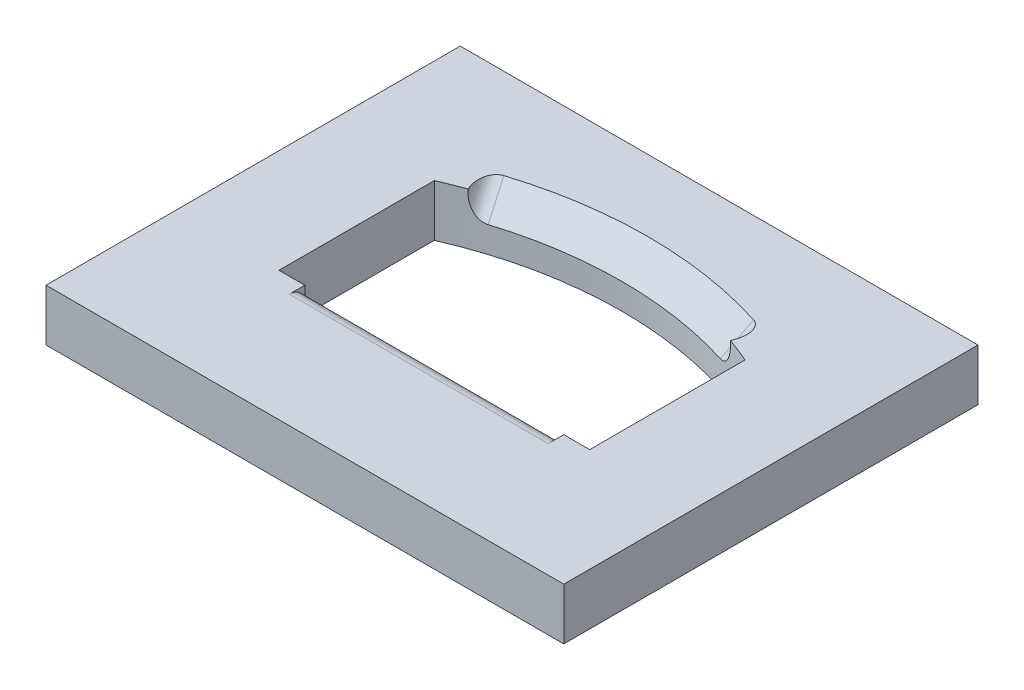
ISO-10303-21;
HEADER;
FILE_DESCRIPTION(('STEP AP214'),'2;1');
FILE_NAME('part.step','',(''),(''),'','','');
FILE_SCHEMA(('AUTOMOTIVE_DESIGN { 1 0 10303 214 1 1 1 1 }'));
ENDSEC;
DATA;
#1=APPLICATION_CONTEXT('core data for automotive mechanical design processes');
#2=APPLICATION_PROTOCOL_DEFINITION('international standard','automotive_design',2000,#1);
#3=PRODUCT_CONTEXT('',#1,'mechanical');
#4=PRODUCT('Part','Part','',(#3));
#5=PRODUCT_RELATED_PRODUCT_CATEGORY('part','',(#4));
#6=PRODUCT_DEFINITION_FORMATION('','',#4);
#7=PRODUCT_DEFINITION_CONTEXT('part definition',#1,'design');
#8=PRODUCT_DEFINITION('design','',#6,#7);
#9=PRODUCT_DEFINITION_SHAPE('','',#8);
#10=(LENGTH_UNIT() NAMED_UNIT(*) SI_UNIT(.MILLI.,.METRE.));
#11=(NAMED_UNIT(*) PLANE_ANGLE_UNIT() SI_UNIT($,.RADIAN.));
#12=(NAMED_UNIT(*) SI_UNIT($,.STERADIAN.) SOLID_ANGLE_UNIT());
#13=UNCERTAINTY_MEASURE_WITH_UNIT(LENGTH_MEASURE(1.E-05),#10,'distance_accuracy_value','');
#14=(GEOMETRIC_REPRESENTATION_CONTEXT(3) GLOBAL_UNCERTAINTY_ASSIGNED_CONTEXT((#13)) GLOBAL_UNIT_ASSIGNED_CONTEXT((#10,
#11,#12)) REPRESENTATION_CONTEXT('',''));
#15=CARTESIAN_POINT('',(0.,0.,0.));
#16=DIRECTION('',(0.,0.,1.));
#17=DIRECTION('',(1.,0.,0.));
#18=AXIS2_PLACEMENT_3D('',#15,#16,#17);
#19=CARTESIAN_POINT('',(50.,10.,40.));
#20=DIRECTION('',(-1.,0.,0.));
#21=DIRECTION('',(0.,0.,1.));
#22=AXIS2_PLACEMENT_3D('',#19,#20,#21);
#23=PLANE('',#22);
#24=DIRECTION('',(0.,0.,-1.));
#25=VECTOR('',#24,1.);
#26=CARTESIAN_POINT('',(50.,0.,40.));
#27=LINE('',#26,#25);
#28=CARTESIAN_POINT('',(50.,0.,40.));
#29=VERTEX_POINT('',#28);
#30=CARTESIAN_POINT('',(50.,0.,-40.));
#31=VERTEX_POINT('',#30);
#32=EDGE_CURVE('E196',#29,#31,#27,.T.);
#33=ORIENTED_EDGE('',*,*,#32,.T.);
#34=DIRECTION('',(0.,-1.,0.));
#35=VECTOR('',#34,1.);
#36=CARTESIAN_POINT('',(50.,10.,-40.));
#37=LINE('',#36,#35);
#38=CARTESIAN_POINT('',(50.,10.,-40.));
#39=VERTEX_POINT('',#38);
#40=EDGE_CURVE('E227',#39,#31,#37,.T.);
#41=ORIENTED_EDGE('',*,*,#40,.F.);
#42=DIRECTION('',(0.,0.,-1.));
#43=VECTOR('',#42,1.);
#44=CARTESIAN_POINT('',(50.,10.,40.));
#45=LINE('',#44,#43);
#46=CARTESIAN_POINT('',(50.,10.,40.));
#47=VERTEX_POINT('',#46);
#48=EDGE_CURVE('E201',#47,#39,#45,.T.);
#49=ORIENTED_EDGE('',*,*,#48,.F.);
#50=DIRECTION('',(0.,-1.,0.));
#51=VECTOR('',#50,1.);
#52=CARTESIAN_POINT('',(50.,10.,40.));
#53=LINE('',#52,#51);
#54=EDGE_CURVE('E211',#47,#29,#53,.T.);
#55=ORIENTED_EDGE('',*,*,#54,.T.);
#56=EDGE_LOOP('',(#33,#41,#49,#55));
#57=FACE_BOUND('',#56,.T.);
#58=ADVANCED_FACE('F41',(#57),#23,.F.);
#59=CARTESIAN_POINT('',(-50.,10.,-40.));
#60=DIRECTION('',(0.,0.,1.));
#61=DIRECTION('',(1.,0.,0.));
#62=AXIS2_PLACEMENT_3D('',#59,#60,#61);
#63=PLANE('',#62);
#64=DIRECTION('',(-1.,0.,0.));
#65=VECTOR('',#64,1.);
#66=CARTESIAN_POINT('',(-50.,0.,-40.));
#67=LINE('',#66,#65);
#68=CARTESIAN_POINT('',(-50.,0.,-40.));
#69=VERTEX_POINT('',#68);
#70=EDGE_CURVE('E214',#31,#69,#67,.T.);
#71=ORIENTED_EDGE('',*,*,#70,.T.);
#72=DIRECTION('',(0.,-1.,0.));
#73=VECTOR('',#72,1.);
#74=CARTESIAN_POINT('',(-50.,10.,-40.));
#75=LINE('',#74,#73);
#76=CARTESIAN_POINT('',(-50.,10.,-40.));
#77=VERTEX_POINT('',#76);
#78=EDGE_CURVE('E224',#77,#69,#75,.T.);
#79=ORIENTED_EDGE('',*,*,#78,.F.);
#80=DIRECTION('',(-1.,0.,0.));
#81=VECTOR('',#80,1.);
#82=CARTESIAN_POINT('',(-50.,10.,-40.));
#83=LINE('',#82,#81);
#84=EDGE_CURVE('E204',#39,#77,#83,.T.);
#85=ORIENTED_EDGE('',*,*,#84,.F.);
#86=ORIENTED_EDGE('',*,*,#40,.T.);
#87=EDGE_LOOP('',(#71,#79,#85,#86));
#88=FACE_BOUND('',#87,.T.);
#89=ADVANCED_FACE('F408',(#88),#63,.F.);
#90=CARTESIAN_POINT('',(-50.,10.,40.));
#91=DIRECTION('',(1.,0.,0.));
#92=DIRECTION('',(0.,0.,-1.));
#93=AXIS2_PLACEMENT_3D('',#90,#91,#92);
#94=PLANE('',#93);
#95=DIRECTION('',(0.,0.,1.));
#96=VECTOR('',#95,1.);
#97=CARTESIAN_POINT('',(-50.,0.,40.));
#98=LINE('',#97,#96);
#99=CARTESIAN_POINT('',(-50.,0.,40.));
#100=VERTEX_POINT('',#99);
#101=EDGE_CURVE('E216',#69,#100,#98,.T.);
#102=ORIENTED_EDGE('',*,*,#101,.T.);
#103=DIRECTION('',(0.,-1.,0.));
#104=VECTOR('',#103,1.);
#105=CARTESIAN_POINT('',(-50.,10.,40.));
#106=LINE('',#105,#104);
#107=CARTESIAN_POINT('',(-50.,10.,40.));
#108=VERTEX_POINT('',#107);
#109=EDGE_CURVE('E221',#108,#100,#106,.T.);
#110=ORIENTED_EDGE('',*,*,#109,.F.);
#111=DIRECTION('',(0.,0.,1.));
#112=VECTOR('',#111,1.);
#113=CARTESIAN_POINT('',(-50.,10.,40.));
#114=LINE('',#113,#112);
#115=EDGE_CURVE('E207',#77,#108,#114,.T.);
#116=ORIENTED_EDGE('',*,*,#115,.F.);
#117=ORIENTED_EDGE('',*,*,#78,.T.);
#118=EDGE_LOOP('',(#102,#110,#116,#117));
#119=FACE_BOUND('',#118,.T.);
#120=ADVANCED_FACE('F413',(#119),#94,.F.);
#121=CARTESIAN_POINT('',(-50.,10.,40.));
#122=DIRECTION('',(0.,0.,-1.));
#123=DIRECTION('',(-1.,0.,0.));
#124=AXIS2_PLACEMENT_3D('',#121,#122,#123);
#125=PLANE('',#124);
#126=DIRECTION('',(1.,0.,0.));
#127=VECTOR('',#126,1.);
#128=CARTESIAN_POINT('',(-50.,0.,40.));
#129=LINE('',#128,#127);
#130=EDGE_CURVE('E205',#100,#29,#129,.T.);
#131=ORIENTED_EDGE('',*,*,#130,.T.);
#132=ORIENTED_EDGE('',*,*,#54,.F.);
#133=DIRECTION('',(1.,0.,0.));
#134=VECTOR('',#133,1.);
#135=CARTESIAN_POINT('',(-50.,10.,40.));
#136=LINE('',#135,#134);
#137=EDGE_CURVE('E209',#108,#47,#136,.T.);
#138=ORIENTED_EDGE('',*,*,#137,.F.);
#139=ORIENTED_EDGE('',*,*,#109,.T.);
#140=EDGE_LOOP('',(#131,#132,#138,#139));
#141=FACE_BOUND('',#140,.T.);
#142=ADVANCED_FACE('F426',(#141),#125,.F.);
#143=CARTESIAN_POINT('',(0.,10.,0.));
#144=DIRECTION('',(0.,-1.,0.));
#145=DIRECTION('',(0.,0.,-1.));
#146=AXIS2_PLACEMENT_3D('',#143,#144,#145);
#147=PLANE('',#146);
#148=DIRECTION('',(1.,0.,0.));
#149=VECTOR('',#148,1.);
#150=CARTESIAN_POINT('',(-30.,10.,15.));
#151=LINE('',#150,#149);
#152=CARTESIAN_POINT('',(25.,10.,15.));
#153=VERTEX_POINT('',#152);
#154=CARTESIAN_POINT('',(30.,10.,15.));
#155=VERTEX_POINT('',#154);
#156=EDGE_CURVE('E191',#153,#155,#151,.T.);
#157=ORIENTED_EDGE('',*,*,#156,.F.);
#158=DIRECTION('',(0.,0.,1.));
#159=VECTOR('',#158,1.);
#160=CARTESIAN_POINT('',(25.,10.,18.));
#161=LINE('',#160,#159);
#162=CARTESIAN_POINT('',(25.,10.,18.));
#163=VERTEX_POINT('',#162);
#164=EDGE_CURVE('E13',#153,#163,#161,.T.);
#165=ORIENTED_EDGE('',*,*,#164,.T.);
#166=DIRECTION('',(1.,0.,0.));
#167=VECTOR('',#166,1.);
#168=CARTESIAN_POINT('',(0.,10.,18.));
#169=LINE('',#168,#167);
#170=CARTESIAN_POINT('',(-25.,10.,18.));
#171=VERTEX_POINT('',#170);
#172=EDGE_CURVE('E50',#163,#171,#169,.F.);
#173=ORIENTED_EDGE('',*,*,#172,.T.);
#174=DIRECTION('',(0.,0.,-1.));
#175=VECTOR('',#174,1.);
#176=CARTESIAN_POINT('',(-25.,10.,18.));
#177=LINE('',#176,#175);
#178=CARTESIAN_POINT('',(-25.,10.,15.));
#179=VERTEX_POINT('',#178);
#180=EDGE_CURVE('E389',#171,#179,#177,.T.);
#181=ORIENTED_EDGE('',*,*,#180,.T.);
#182=CARTESIAN_POINT('',(-30.,10.,15.));
#183=VERTEX_POINT('',#182);
#184=EDGE_CURVE('E182',#183,#179,#151,.T.);
#185=ORIENTED_EDGE('',*,*,#184,.F.);
#186=DIRECTION('',(0.,0.,1.));
#187=VECTOR('',#186,1.);
#188=CARTESIAN_POINT('',(-30.,10.,15.));
#189=LINE('',#188,#187);
#190=CARTESIAN_POINT('',(-30.,10.,-15.));
#191=VERTEX_POINT('',#190);
#192=EDGE_CURVE('E189',#191,#183,#189,.T.);
#193=ORIENTED_EDGE('',*,*,#192,.F.);
#194=CARTESIAN_POINT('',(0.,10.,53.7386354243376));
#195=DIRECTION('',(0.,1.,0.));
#196=DIRECTION('',(0.,0.,-1.));
#197=AXIS2_PLACEMENT_3D('',#194,#195,#196);
#198=CIRCLE('',#197,75.);
#199=CARTESIAN_POINT('',(-25.354176072339,10.,-16.8458228911643));
#200=VERTEX_POINT('',#199);
#201=EDGE_CURVE('E161',#200,#191,#198,.T.);
#202=ORIENTED_EDGE('',*,*,#201,.F.);
#203=DIRECTION('',(-0.33805568096452,0.,-0.941126110873359));
#204=VECTOR('',#203,1.);
#205=CARTESIAN_POINT('',(-27.0444544771616,10.,-21.5514534455311));
#206=LINE('',#205,#204);
#207=CARTESIAN_POINT('',(-25.5901172471605,10.,-17.5026685315663));
#208=VERTEX_POINT('',#207);
#209=EDGE_CURVE('E243',#200,#208,#206,.T.);
#210=ORIENTED_EDGE('',*,*,#209,.T.);
#211=CARTESIAN_POINT('',(-15.341026099761,-20.278129767522,11.0301674320778));
#212=CARTESIAN_POINT('',(-16.0915980566567,-22.5032374034775,8.94062151849197));
#213=CARTESIAN_POINT('',(-13.1015173957033,-22.3994501110817,7.97661414405011));
#214=CARTESIAN_POINT('',(-16.185641510913,-17.7850696809049,8.67881035736964));
#215=CARTESIAN_POINT('',(-16.933474916181,-20.0070050573796,6.59688840216692));
#216=CARTESIAN_POINT('',(-13.953452419433,-19.9063900244761,5.62735850225259));
#217=CARTESIAN_POINT('',(-17.0301237562112,-15.2916149406375,6.32782400816378));
#218=CARTESIAN_POINT('',(-17.7765506018133,-17.5081123887797,4.24981782809106));
#219=CARTESIAN_POINT('',(-14.8041758774212,-17.4129352842042,3.27819555810608));
#220=CARTESIAN_POINT('',(-18.7188926284986,-10.3041259654752,1.62639589902743));
#221=CARTESIAN_POINT('',(-19.4625008257368,-12.5122247190142,-0.443763338301699));
#222=CARTESIAN_POINT('',(-16.5038457801787,-12.4254463090275,-1.42000418793042));
#223=CARTESIAN_POINT('',(-19.5631792554922,-7.81009173059315,-0.724045860915278));
#224=CARTESIAN_POINT('',(-20.3058571244509,-10.0137995818179,-2.7916151218447));
#225=CARTESIAN_POINT('',(-17.3527922249879,-9.93141207413562,-3.76904098982323));
#226=CARTESIAN_POINT('',(-21.2516276111724,-2.82165355943166,-5.42458167163756));
#227=CARTESIAN_POINT('',(-21.9922713282281,-5.01865099588145,-7.48648797945833));
#228=CARTESIAN_POINT('',(-19.0495542263775,-4.94297390297567,-8.46704772274569));
#229=CARTESIAN_POINT('',(-22.0957893398637,-0.327249623165894,-7.77467572243003));
#230=CARTESIAN_POINT('',(-22.8356352368848,-2.5210199420408,-9.83436094861081));
#231=CARTESIAN_POINT('',(-19.8973697829999,-2.44856996672133,-10.8160176537778));
#232=CARTESIAN_POINT('',(-23.7840224041188,4.66182593418679,-12.4746121751383));
#233=CARTESIAN_POINT('',(-24.5222183018129,2.47322738990698,-14.5297039052264));
#234=CARTESIAN_POINT('',(-21.5921835096169,2.54050559062296,-15.5139138239932));
#235=CARTESIAN_POINT('',(-24.6280937396821,7.15649755527555,-14.8244545770524));
#236=CARTESIAN_POINT('',(-25.3656580688959,4.97049762588231,-16.8777880595468));
#237=CARTESIAN_POINT('',(-22.4391816796059,5.03517721171472,-17.8628400631761));
#238=CARTESIAN_POINT('',(-26.897419949208,13.8640587716554,-21.1421184121359));
#239=CARTESIAN_POINT('',(-27.632433856846,11.6814431713192,-23.1883516786781));
#240=CARTESIAN_POINT('',(-24.7156756437606,11.7427384280978,-24.1782469145515));
#241=CARTESIAN_POINT('',(-28.3226146304797,18.077126560508,-25.1097722725761));
#242=CARTESIAN_POINT('',(-29.056990927457,15.8983483138198,-27.1542304704681));
#243=CARTESIAN_POINT('',(-26.1446281679678,15.9558062169472,-28.1447019942585));
#244=CARTESIAN_POINT('',(-31.172887836469,26.5036059179069,-33.0447566207931));
#245=CARTESIAN_POINT('',(-31.9056336064399,24.3300253033741,-35.0846755323286));
#246=CARTESIAN_POINT('',(-29.0014872049372,24.3822855743485,-36.0775708670134));
#247=CARTESIAN_POINT('',(-32.5979663611868,30.7170174864528,-37.0120871085703));
#248=CARTESIAN_POINT('',(-33.3301941535161,28.5462037882269,-39.0505640023827));
#249=CARTESIAN_POINT('',(-30.4293937177007,28.5956971429,-40.0439846600614));
#250=CARTESIAN_POINT('',(-35.448045558713,39.1440715100614,-44.946531349223));
#251=CARTESIAN_POINT('',(-36.1790003304765,36.9771380308846,-46.9814642325025));
#252=CARTESIAN_POINT('',(-33.2845061425562,37.0227511665097,-47.9767885985296));
#253=CARTESIAN_POINT('',(-36.8730462315168,43.3577139651377,-48.9136451020858));
#254=CARTESIAN_POINT('',(-37.6035635395707,41.192834094062,-50.94736011345));
#255=CARTESIAN_POINT('',(-34.711712054607,41.2363936215814,-51.9431787439484));
#256=CARTESIAN_POINT('',(-39.7229911611732,51.7851657998844,-56.847715549292));
#257=CARTESIAN_POINT('',(-40.4525607038417,49.6234908014084,-58.8787920404319));
#258=CARTESIAN_POINT('',(-37.5656172680509,49.6638454563215,-59.8759436112245));
#259=CARTESIAN_POINT('',(-41.1479354180259,55.9989751795546,-60.8146722436357));
#260=CARTESIAN_POINT('',(-41.8772239021114,53.8391300637427,-62.8449662850608));
#261=CARTESIAN_POINT('',(-38.992316569445,53.8776548359895,-63.8423183330817));
#262=CARTESIAN_POINT('',(-42.5728622296947,60.2128361730352,-64.7815803716663));
#263=CARTESIAN_POINT('',(-43.3020628673881,58.0551812241364,-66.8116298541679));
#264=CARTESIAN_POINT('',(-40.4188596054444,58.0915158294756,-67.80868957991));
#265=(BOUNDED_SURFACE() B_SPLINE_SURFACE(3,2,((#211,#212,#213),(#214,#215,#216),(#217,#218,
#219),(#220,#221,#222),(#223,#224,#225),(#226,#227,#228),(#229,#230,#231),(#232,#233,#234),
(#235,#236,#237),(#238,#239,#240),(#241,#242,#243),(#244,#245,#246),(#247,#248,#249),(#250,#251,
#252),(#253,#254,#255),(#256,#257,#258),(#259,#260,#261),(#262,#263,#264)),.UNSPECIFIED.,.F.,
.F.,.F.) B_SPLINE_SURFACE_WITH_KNOTS((4,2,2,2,2,2,2,2,4),(3,3),(0.,10.5885991310839,
21.1771980244958,31.7657965252435,42.3543950981588,60.2348473800191,78.1152996400775,
95.9957529471584,113.876206215527),(0.,1.),
.UNSPECIFIED.) GEOMETRIC_REPRESENTATION_ITEM() RATIONAL_B_SPLINE_SURFACE(((1.,0.690418815760579,
1.),(1.,0.691335768691514,1.),(1.,0.692117568744666,1.),(1.,0.693483002103694,1.),(1.,
0.694066635414018,1.),(1.,0.69510787431106,1.),(1.,0.695565479902452,1.),(1.,0.696389623747261,
1.),(1.,0.696756162000058,1.),(1.,0.697653793431372,1.),(1.,0.698124380198337,1.),(1.,
0.698949099199717,1.),(1.,0.699303231434274,1.),(1.,0.699933507666037,1.),(1.,0.700209651658676,
1.),(1.,0.7007055625443,1.),(1.,0.700925329437407,1.),(1.,0.701127713363917,1.))) REPRESENTATION_ITEM('') SURFACE());
#266=CARTESIAN_POINT('',(-25.5901172471605,9.99999999999999,-17.5026685315663));
#267=CARTESIAN_POINT('',(-25.645020660919,10.,-17.6556112821371));
#268=CARTESIAN_POINT('',(-25.6937814679808,10.,-17.8107826950909));
#269=CARTESIAN_POINT('',(-25.778480680203,10.,-18.1248169688672));
#270=CARTESIAN_POINT('',(-25.8144008980893,10.,-18.2836847288327));
#271=CARTESIAN_POINT('',(-25.8730096227391,10.,-18.6054800745748));
#272=CARTESIAN_POINT('',(-25.8955648105107,10.,-18.7684322024234));
#273=CARTESIAN_POINT('',(-25.9259689771769,10.,-19.0955912907264));
#274=CARTESIAN_POINT('',(-25.933827912326,10.,-19.2597973259188));
#275=CARTESIAN_POINT('',(-25.9337053162388,10.,-19.6527924993402));
#276=CARTESIAN_POINT('',(-25.9182993617671,10.,-19.8816442834149));
#277=CARTESIAN_POINT('',(-25.8527282403553,10.,-20.3338687484994));
#278=CARTESIAN_POINT('',(-25.8026827858363,10.,-20.5572575648266));
#279=CARTESIAN_POINT('',(-25.6809710090692,10.,-20.9352148715046));
#280=CARTESIAN_POINT('',(-25.6182418601161,10.,-21.0926421122117));
#281=CARTESIAN_POINT('',(-25.4687575021447,10.,-21.3957966626129));
#282=CARTESIAN_POINT('',(-25.3820268642534,10.,-21.5415357421114));
#283=CARTESIAN_POINT('',(-25.2033939231539,10.,-21.7870548994211));
#284=CARTESIAN_POINT('',(-25.1160912715154,10.,-21.8901667929068));
#285=CARTESIAN_POINT('',(-24.925775373747,10.,-22.0805167937721));
#286=CARTESIAN_POINT('',(-24.822795879802,10.,-22.1677881413643));
#287=CARTESIAN_POINT('',(-24.6230154382973,10.,-22.3081962669877));
#288=CARTESIAN_POINT('',(-24.5285589770708,10.,-22.3646588177986));
#289=CARTESIAN_POINT('',(-24.3810533386727,10.,-22.4380911550368));
#290=CARTESIAN_POINT('',(-24.3307739343377,10.,-22.4607365079132));
#291=CARTESIAN_POINT('',(-24.2285862923413,10.,-22.5020622665809));
#292=CARTESIAN_POINT('',(-24.1766773590331,10.,-22.5207409518352));
#293=CARTESIAN_POINT('',(-24.1240976434481,10.,-22.537362850935));
#294=B_SPLINE_CURVE_WITH_KNOTS('',3,(#266,#267,#268,#269,#270,#271,#272,#273,#274,#275,#276,
#277,#278,#279,#280,#281,#282,#283,#284,#285,#286,#287,#288,#289,#290,#291,#292,#293),
.UNSPECIFIED.,.F.,.F.,(4,2,2,2,2,2,2,2,2,2,2,2,2,4),(0.,0.487396649812347,0.97548093303895,
1.46835539231208,1.96089582331648,2.64667606343724,3.33009803734509,3.83679745909635,
4.34298006249173,4.74671231212316,5.14958730994084,5.47839856476223,5.64368044435846,
5.8090338689868),.UNSPECIFIED.);
#295=CARTESIAN_POINT('',(-24.1240976434481,10.,-22.537362850935));
#296=VERTEX_POINT('',#295);
#297=EDGE_CURVE('E297',#208,#296,#294,.T.);
#298=ORIENTED_EDGE('',*,*,#297,.T.);
#299=CARTESIAN_POINT('',(0.,10.,53.7386354243376));
#300=DIRECTION('',(0.,-1.,0.));
#301=DIRECTION('',(0.,0.,-1.));
#302=AXIS2_PLACEMENT_3D('',#299,#300,#301);
#303=CIRCLE('',#302,80.);
#304=CARTESIAN_POINT('',(24.1240976434481,10.,-22.537362850935));
#305=VERTEX_POINT('',#304);
#306=EDGE_CURVE('E240',#296,#305,#303,.T.);
#307=ORIENTED_EDGE('',*,*,#306,.T.);
#308=CARTESIAN_POINT('',(13.1015173957033,-22.3994501110817,7.97661414405011));
#309=CARTESIAN_POINT('',(16.0915980566568,-22.5032374034775,8.94062151849196));
#310=CARTESIAN_POINT('',(15.341026099761,-20.278129767522,11.0301674320778));
#311=CARTESIAN_POINT('',(13.953452419433,-19.9063900244761,5.62735850225259));
#312=CARTESIAN_POINT('',(16.933474916181,-20.0070050573796,6.59688840216693));
#313=CARTESIAN_POINT('',(16.1856415109131,-17.7850696809049,8.67881035736964));
#314=CARTESIAN_POINT('',(14.8041758774212,-17.4129352842042,3.27819555810608));
#315=CARTESIAN_POINT('',(17.7765506018133,-17.5081123887797,4.24981782809106));
#316=CARTESIAN_POINT('',(17.0301237562112,-15.2916149406375,6.32782400816378));
#317=CARTESIAN_POINT('',(16.5038457801787,-12.4254463090275,-1.42000418793042));
#318=CARTESIAN_POINT('',(19.4625008257368,-12.5122247190142,-0.443763338301704));
#319=CARTESIAN_POINT('',(18.7188926284986,-10.3041259654751,1.62639589902743));
#320=CARTESIAN_POINT('',(17.3527922249879,-9.93141207413561,-3.76904098982324));
#321=CARTESIAN_POINT('',(20.3058571244509,-10.0137995818179,-2.79161512184471));
#322=CARTESIAN_POINT('',(19.5631792554922,-7.81009173059314,-0.724045860915286));
#323=CARTESIAN_POINT('',(19.0495542263776,-4.94297390297566,-8.46704772274569));
#324=CARTESIAN_POINT('',(21.9922713282281,-5.01865099588144,-7.48648797945834));
#325=CARTESIAN_POINT('',(21.2516276111724,-2.82165355943166,-5.42458167163757));
#326=CARTESIAN_POINT('',(19.897369783,-2.44856996672132,-10.8160176537778));
#327=CARTESIAN_POINT('',(22.8356352368848,-2.5210199420408,-9.83436094861081));
#328=CARTESIAN_POINT('',(22.0957893398637,-0.327249623165889,-7.77467572243004));
#329=CARTESIAN_POINT('',(21.5921835096169,2.54050559062297,-15.5139138239932));
#330=CARTESIAN_POINT('',(24.5222183018129,2.47322738990698,-14.5297039052264));
#331=CARTESIAN_POINT('',(23.7840224041188,4.6618259341868,-12.4746121751383));
#332=CARTESIAN_POINT('',(22.439181679606,5.03517721171474,-17.8628400631761));
#333=CARTESIAN_POINT('',(25.3656580688959,4.97049762588231,-16.8777880595468));
#334=CARTESIAN_POINT('',(24.6280937396821,7.15649755527556,-14.8244545770524));
#335=CARTESIAN_POINT('',(24.7156756437606,11.7427384280978,-24.1782469145515));
#336=CARTESIAN_POINT('',(27.632433856846,11.6814431713192,-23.1883516786782));
#337=CARTESIAN_POINT('',(26.897419949208,13.8640587716554,-21.1421184121359));
#338=CARTESIAN_POINT('',(26.1446281679678,15.9558062169472,-28.1447019942585));
#339=CARTESIAN_POINT('',(29.0569909274571,15.8983483138198,-27.1542304704682));
#340=CARTESIAN_POINT('',(28.3226146304797,18.0771265605081,-25.1097722725761));
#341=CARTESIAN_POINT('',(29.0014872049373,24.3822855743485,-36.0775708670134));
#342=CARTESIAN_POINT('',(31.9056336064399,24.3300253033741,-35.0846755323286));
#343=CARTESIAN_POINT('',(31.1728878364691,26.503605917907,-33.0447566207931));
#344=CARTESIAN_POINT('',(30.4293937177008,28.5956971429,-40.0439846600614));
#345=CARTESIAN_POINT('',(33.3301941535161,28.5462037882269,-39.0505640023827));
#346=CARTESIAN_POINT('',(32.5979663611869,30.7170174864528,-37.0120871085703));
#347=CARTESIAN_POINT('',(33.2845061425562,37.0227511665097,-47.9767885985296));
#348=CARTESIAN_POINT('',(36.1790003304766,36.9771380308846,-46.9814642325025));
#349=CARTESIAN_POINT('',(35.448045558713,39.1440715100615,-44.946531349223));
#350=CARTESIAN_POINT('',(34.7117120546071,41.2363936215814,-51.9431787439484));
#351=CARTESIAN_POINT('',(37.6035635395708,41.192834094062,-50.94736011345));
#352=CARTESIAN_POINT('',(36.8730462315168,43.3577139651377,-48.9136451020858));
#353=CARTESIAN_POINT('',(37.5656172680509,49.6638454563215,-59.8759436112245));
#354=CARTESIAN_POINT('',(40.4525607038418,49.6234908014084,-58.8787920404319));
#355=CARTESIAN_POINT('',(39.7229911611732,51.7851657998845,-56.847715549292));
#356=CARTESIAN_POINT('',(38.992316569445,53.8776548359895,-63.8423183330817));
#357=CARTESIAN_POINT('',(41.8772239021114,53.8391300637427,-62.8449662850607));
#358=CARTESIAN_POINT('',(41.1479354180259,55.9989751795546,-60.8146722436357));
#359=CARTESIAN_POINT('',(40.4188596054444,58.0915158294756,-67.80868957991));
#360=CARTESIAN_POINT('',(43.3020628673881,58.0551812241364,-66.8116298541678));
#361=CARTESIAN_POINT('',(42.5728622296947,60.2128361730353,-64.7815803716663));
#362=(BOUNDED_SURFACE() B_SPLINE_SURFACE(3,2,((#308,#309,#310),(#311,#312,#313),(#314,#315,
#316),(#317,#318,#319),(#320,#321,#322),(#323,#324,#325),(#326,#327,#328),(#329,#330,#331),
(#332,#333,#334),(#335,#336,#337),(#338,#339,#340),(#341,#342,#343),(#344,#345,#346),(#347,#348,
#349),(#350,#351,#352),(#353,#354,#355),(#356,#357,#358),(#359,#360,#361)),.UNSPECIFIED.,.F.,
.F.,.F.) B_SPLINE_SURFACE_WITH_KNOTS((4,2,2,2,2,2,2,2,4),(3,3),(0.,10.5885991310839,
21.1771980244958,31.7657965252435,42.3543950981588,60.2348473800191,78.1152996400775,
95.9957529471584,113.876206215527),(0.,1.),
.UNSPECIFIED.) GEOMETRIC_REPRESENTATION_ITEM() RATIONAL_B_SPLINE_SURFACE(((1.,0.690418815760579,
1.),(1.,0.691335768691514,1.),(1.,0.692117568744666,1.),(1.,0.693483002103694,1.),(1.,
0.694066635414018,1.),(1.,0.69510787431106,1.),(1.,0.695565479902452,1.),(1.,0.696389623747261,
1.),(1.,0.696756162000058,1.),(1.,0.697653793431371,1.),(1.,0.698124380198337,1.),(1.,
0.698949099199717,1.),(1.,0.699303231434274,1.),(1.,0.699933507666037,1.),(1.,0.700209651658677,
1.),(1.,0.700705562544301,1.),(1.,0.700925329437408,1.),(1.,0.701127713363917,1.))) REPRESENTATION_ITEM('') SURFACE());
#363=CARTESIAN_POINT('',(24.1240976434481,10.,-22.537362850935));
#364=CARTESIAN_POINT('',(24.1872590873717,10.,-22.5174116501919));
#365=CARTESIAN_POINT('',(24.2494633325359,10.,-22.494463627422));
#366=CARTESIAN_POINT('',(24.3714259174303,10.,-22.4428908008632));
#367=CARTESIAN_POINT('',(24.4311858238589,10.,-22.4142697042571));
#368=CARTESIAN_POINT('',(24.5473450942184,10.,-22.3518914332892));
#369=CARTESIAN_POINT('',(24.6037675253822,10.,-22.3181771968135));
#370=CARTESIAN_POINT('',(24.7133817873761,10.,-22.2458750584414));
#371=CARTESIAN_POINT('',(24.7665732769416,10.,-22.2072866430365));
#372=CARTESIAN_POINT('',(24.9205949760351,10.,-22.0850865098966));
#373=CARTESIAN_POINT('',(25.0162510411264,10.,-21.9948330639046));
#374=CARTESIAN_POINT('',(25.1924631649333,10.,-21.8005560691583));
#375=CARTESIAN_POINT('',(25.2729872656426,10.,-21.6965041514065));
#376=CARTESIAN_POINT('',(25.4465857884969,10.,-21.4368557174955));
#377=CARTESIAN_POINT('',(25.5328237216046,10.,-21.276684871843));
#378=CARTESIAN_POINT('',(25.6784296343332,10.,-20.9446496140886));
#379=CARTESIAN_POINT('',(25.7377520196279,10.,-20.7727659228626));
#380=CARTESIAN_POINT('',(25.8503965096354,10.,-20.3550949212394));
#381=CARTESIAN_POINT('',(25.8926146892932,10.,-20.1063330331609));
#382=CARTESIAN_POINT('',(25.9371173021117,10.,-19.6049513855832));
#383=CARTESIAN_POINT('',(25.939288411094,10.,-19.3523227022298));
#384=CARTESIAN_POINT('',(25.9154001757558,10.,-18.9641216946558));
#385=CARTESIAN_POINT('',(25.9017473169645,10.,-18.8276369452131));
#386=CARTESIAN_POINT('',(25.8645319570113,10.,-18.5559782189318));
#387=CARTESIAN_POINT('',(25.8409675297499,10.,-18.4208045020904));
#388=CARTESIAN_POINT('',(25.7846402476201,10.,-18.1535857064349));
#389=CARTESIAN_POINT('',(25.7519560970594,10.,-18.0215239051263));
#390=CARTESIAN_POINT('',(25.6776539583271,10.,-17.7600135778401));
#391=CARTESIAN_POINT('',(25.6360408304637,10.,-17.6305636719032));
#392=CARTESIAN_POINT('',(25.5901172471605,10.,-17.5026685315663));
#393=B_SPLINE_CURVE_WITH_KNOTS('',3,(#363,#364,#365,#366,#367,#368,#369,#370,#371,#372,#373,
#374,#375,#376,#377,#378,#379,#380,#381,#382,#383,#384,#385,#386,#387,#388,#389,#390,#391,#392),
.UNSPECIFIED.,.F.,.F.,(4,2,2,2,2,2,2,2,2,2,2,2,2,2,4),(0.,0.198623947624911,0.397118525870949,
0.594024526045878,0.790951288151896,1.1835280624391,1.5769248449453,2.11963380779164,
2.66325870597992,3.41618714742263,4.17124588070922,4.58243356535743,4.99370119240409,
5.40152382489068,5.80912502799031),.UNSPECIFIED.);
#394=CARTESIAN_POINT('',(25.5901172471605,10.,-17.5026685315663));
#395=VERTEX_POINT('',#394);
#396=EDGE_CURVE('E343',#305,#395,#393,.T.);
#397=ORIENTED_EDGE('',*,*,#396,.T.);
#398=DIRECTION('',(-0.33805568096452,0.,0.941126110873359));
#399=VECTOR('',#398,1.);
#400=CARTESIAN_POINT('',(27.0444544771616,10.,-21.5514534455311));
#401=LINE('',#400,#399);
#402=CARTESIAN_POINT('',(25.354176072339,10.,-16.8458228911643));
#403=VERTEX_POINT('',#402);
#404=EDGE_CURVE('E238',#395,#403,#401,.T.);
#405=ORIENTED_EDGE('',*,*,#404,.T.);
#406=CARTESIAN_POINT('',(30.,10.,-15.));
#407=VERTEX_POINT('',#406);
#408=EDGE_CURVE('E187',#407,#403,#198,.T.);
#409=ORIENTED_EDGE('',*,*,#408,.F.);
#410=DIRECTION('',(0.,0.,-1.));
#411=VECTOR('',#410,1.);
#412=CARTESIAN_POINT('',(30.,10.,15.));
#413=LINE('',#412,#411);
#414=EDGE_CURVE('E179',#155,#407,#413,.T.);
#415=ORIENTED_EDGE('',*,*,#414,.F.);
#416=EDGE_LOOP('',(#157,#165,#173,#181,#185,#193,#202,#210,#298,#307,#397,#405,#409,#415));
#417=FACE_BOUND('',#416,.T.);
#418=ORIENTED_EDGE('',*,*,#48,.T.);
#419=ORIENTED_EDGE('',*,*,#84,.T.);
#420=ORIENTED_EDGE('',*,*,#115,.T.);
#421=ORIENTED_EDGE('',*,*,#137,.T.);
#422=EDGE_LOOP('',(#418,#419,#420,#421));
#423=FACE_BOUND('',#422,.T.);
#424=ADVANCED_FACE('F353',(#417,#423),#147,.F.);
#425=CARTESIAN_POINT('',(0.,0.,0.));
#426=DIRECTION('',(0.,-1.,0.));
#427=DIRECTION('',(0.,0.,-1.));
#428=AXIS2_PLACEMENT_3D('',#425,#426,#427);
#429=PLANE('',#428);
#430=CARTESIAN_POINT('',(0.,0.,53.7386354243376));
#431=DIRECTION('',(0.,1.,0.));
#432=DIRECTION('',(0.,0.,-1.));
#433=AXIS2_PLACEMENT_3D('',#430,#431,#432);
#434=CIRCLE('',#433,75.);
#435=CARTESIAN_POINT('',(30.,0.,-15.));
#436=VERTEX_POINT('',#435);
#437=CARTESIAN_POINT('',(-30.,0.,-15.));
#438=VERTEX_POINT('',#437);
#439=EDGE_CURVE('E158',#436,#438,#434,.T.);
#440=ORIENTED_EDGE('',*,*,#439,.T.);
#441=DIRECTION('',(0.,0.,1.));
#442=VECTOR('',#441,1.);
#443=CARTESIAN_POINT('',(-30.,0.,15.));
#444=LINE('',#443,#442);
#445=CARTESIAN_POINT('',(-30.,0.,15.));
#446=VERTEX_POINT('',#445);
#447=EDGE_CURVE('E170',#438,#446,#444,.T.);
#448=ORIENTED_EDGE('',*,*,#447,.T.);
#449=DIRECTION('',(1.,0.,0.));
#450=VECTOR('',#449,1.);
#451=CARTESIAN_POINT('',(-30.,0.,15.));
#452=LINE('',#451,#450);
#453=CARTESIAN_POINT('',(30.,0.,15.));
#454=VERTEX_POINT('',#453);
#455=EDGE_CURVE('E174',#446,#454,#452,.T.);
#456=ORIENTED_EDGE('',*,*,#455,.T.);
#457=DIRECTION('',(0.,0.,-1.));
#458=VECTOR('',#457,1.);
#459=CARTESIAN_POINT('',(30.,0.,15.));
#460=LINE('',#459,#458);
#461=EDGE_CURVE('E166',#454,#436,#460,.T.);
#462=ORIENTED_EDGE('',*,*,#461,.T.);
#463=EDGE_LOOP('',(#440,#448,#456,#462));
#464=FACE_BOUND('',#463,.T.);
#465=ORIENTED_EDGE('',*,*,#32,.F.);
#466=ORIENTED_EDGE('',*,*,#130,.F.);
#467=ORIENTED_EDGE('',*,*,#101,.F.);
#468=ORIENTED_EDGE('',*,*,#70,.F.);
#469=EDGE_LOOP('',(#465,#466,#467,#468));
#470=FACE_BOUND('',#469,.T.);
#471=ADVANCED_FACE('F176',(#464,#470),#429,.T.);
#472=CARTESIAN_POINT('',(0.,0.,53.7386354243376));
#473=DIRECTION('',(0.,1.,0.));
#474=DIRECTION('',(0.,0.,1.));
#475=AXIS2_PLACEMENT_3D('',#472,#473,#474);
#476=CYLINDRICAL_SURFACE('',#475,75.);
#477=ORIENTED_EDGE('',*,*,#408,.T.);
#478=DIRECTION('',(0.,1.,0.));
#479=VECTOR('',#478,1.);
#480=CARTESIAN_POINT('',(25.354176072339,0.,-16.8458228911643));
#481=LINE('',#480,#479);
#482=CARTESIAN_POINT('',(25.354176072339,9.30261670630011,-16.8458228911643));
#483=VERTEX_POINT('',#482);
#484=EDGE_CURVE('E235',#403,#483,#481,.F.);
#485=ORIENTED_EDGE('',*,*,#484,.T.);
#486=CARTESIAN_POINT('',(25.354176072339,9.30261670630011,-16.8458228911643));
#487=CARTESIAN_POINT('',(25.354145904102,9.14019881656588,-16.8458296451787));
#488=CARTESIAN_POINT('',(25.3479624954341,8.97776072945686,-16.8480546679407));
#489=CARTESIAN_POINT('',(25.3230559785008,8.65375953038568,-16.8569959240203));
#490=CARTESIAN_POINT('',(25.3043161782877,8.49219787209599,-16.8637181356966));
#491=CARTESIAN_POINT('',(25.2538271165144,8.16980017904352,-16.8817929809425));
#492=CARTESIAN_POINT('',(25.221957597796,8.00898512911323,-16.8931884127289));
#493=CARTESIAN_POINT('',(25.144804774001,7.69113035137994,-16.9206913752211));
#494=CARTESIAN_POINT('',(25.0995300232407,7.534088284799,-16.9367959008192));
#495=CARTESIAN_POINT('',(24.9725849360036,7.15908055151194,-16.9817745348294));
#496=CARTESIAN_POINT('',(24.8836307623383,6.9438029232442,-17.0131639920247));
#497=CARTESIAN_POINT('',(24.6753620335208,6.53086767583353,-17.0860682701894));
#498=CARTESIAN_POINT('',(24.5561525619055,6.33315220444134,-17.1275480249583));
#499=CARTESIAN_POINT('',(24.3193838317365,6.01022941792512,-17.2090848058904));
#500=CARTESIAN_POINT('',(24.2089138808417,5.8792757025221,-17.2468879394288));
#501=CARTESIAN_POINT('',(23.9694537462046,5.63735715320008,-17.3281023444918));
#502=CARTESIAN_POINT('',(23.840479553784,5.52637524447984,-17.3715087704503));
#503=CARTESIAN_POINT('',(23.5924879179335,5.35053418277767,-17.4541171692798));
#504=CARTESIAN_POINT('',(23.4765812253171,5.28089233693866,-17.4924417436386));
#505=CARTESIAN_POINT('',(23.235358255938,5.16271025144919,-17.5714909606371));
#506=CARTESIAN_POINT('',(23.1100640972609,5.11412213312955,-17.6122099159077));
#507=CARTESIAN_POINT('',(22.8914931415127,5.05228842162107,-17.6825695235972));
#508=CARTESIAN_POINT('',(22.7998551549887,5.03281769390454,-17.7118790011674));
#509=CARTESIAN_POINT('',(22.6609758298025,5.01320218309286,-17.7559975845689));
#510=CARTESIAN_POINT('',(22.614366144427,5.00826192063854,-17.7707544327765));
#511=CARTESIAN_POINT('',(22.5208884561937,5.00165805350284,-17.8002490602665));
#512=CARTESIAN_POINT('',(22.4740203548081,4.99999579983268,-17.8149868291857));
#513=CARTESIAN_POINT('',(22.4271256624706,4.99999999999999,-17.829681829317));
#514=B_SPLINE_CURVE_WITH_KNOTS('',3,(#486,#487,#488,#489,#490,#491,#492,#493,#494,#495,#496,
#497,#498,#499,#500,#501,#502,#503,#504,#505,#506,#507,#508,#509,#510,#511,#512,#513),
.UNSPECIFIED.,.F.,.F.,(4,2,2,2,2,2,2,2,2,2,2,2,2,4),(0.,0.487152311652914,0.974953511684111,
1.46732555546887,1.95938407526831,2.66201515634998,3.36223846132181,3.88678761688646,
4.41088615870836,4.83088392188629,5.2499214826443,5.54356357831355,5.6908805263939,
5.83825817757277),.UNSPECIFIED.);
#515=CARTESIAN_POINT('',(22.4271256624706,5.,-17.829681829317));
#516=VERTEX_POINT('',#515);
#517=EDGE_CURVE('E331',#483,#516,#514,.T.);
#518=ORIENTED_EDGE('',*,*,#517,.T.);
#519=CARTESIAN_POINT('',(0.,5.,53.7386354243376));
#520=DIRECTION('',(0.,-1.,0.));
#521=DIRECTION('',(0.,0.,-1.));
#522=AXIS2_PLACEMENT_3D('',#519,#520,#521);
#523=CIRCLE('',#522,75.);
#524=CARTESIAN_POINT('',(-22.4271256624706,5.,-17.829681829317));
#525=VERTEX_POINT('',#524);
#526=EDGE_CURVE('E232',#516,#525,#523,.F.);
#527=ORIENTED_EDGE('',*,*,#526,.T.);
#528=CARTESIAN_POINT('',(-22.4271256624706,5.,-17.829681829317));
#529=CARTESIAN_POINT('',(-22.4933629758991,4.99997746065698,-17.8089264587442));
#530=CARTESIAN_POINT('',(-22.5595553351945,5.00330669528196,-17.7880818342967));
#531=CARTESIAN_POINT('',(-22.6912411512884,5.01645446876524,-17.7464140266862));
#532=CARTESIAN_POINT('',(-22.7567351391365,5.0262676571089,-17.7255908400107));
#533=CARTESIAN_POINT('',(-22.8859939820384,5.0520635309275,-17.6843010604434));
#534=CARTESIAN_POINT('',(-22.9497686131804,5.06799495687521,-17.6638329436102));
#535=CARTESIAN_POINT('',(-23.0756743527468,5.10568360799439,-17.6232425964158));
#536=CARTESIAN_POINT('',(-23.1378051938585,5.12744177438715,-17.6031204224958));
#537=CARTESIAN_POINT('',(-23.3207343786883,5.20072402674533,-17.5436183585594));
#538=CARTESIAN_POINT('',(-23.4385904927848,5.26036454551478,-17.5049362149869));
#539=CARTESIAN_POINT('',(-23.6642573428113,5.39778853883382,-17.4302984481579));
#540=CARTESIAN_POINT('',(-23.7720449181745,5.47561246856953,-17.3943491449288));
#541=CARTESIAN_POINT('',(-24.0177746122931,5.68029512305388,-17.3118356453252));
#542=CARTESIAN_POINT('',(-24.1503301154677,5.81426752637519,-17.2668428920148));
#543=CARTESIAN_POINT('',(-24.3930758431897,6.10291276147384,-17.1838177531445));
#544=CARTESIAN_POINT('',(-24.5032284185032,6.25761972675713,-17.1457970949108));
#545=CARTESIAN_POINT('',(-24.7378651048826,6.64006731337881,-17.0643211084273));
#546=CARTESIAN_POINT('',(-24.853204085586,6.87403306410578,-17.0238464703148));
#547=CARTESIAN_POINT('',(-25.0471377978225,7.35867954605613,-16.9554338893535));
#548=CARTESIAN_POINT('',(-25.125650736107,7.60939608525212,-16.927523858861));
#549=CARTESIAN_POINT('',(-25.2151298054371,7.98227860322475,-16.8956200843064));
#550=CARTESIAN_POINT('',(-25.2397039080893,8.10097714502723,-16.8868403371469));
#551=CARTESIAN_POINT('',(-25.2816769697626,8.33981974841372,-16.8718264299215));
#552=CARTESIAN_POINT('',(-25.2990758067444,8.45996383454828,-16.8655923131526));
#553=CARTESIAN_POINT('',(-25.3267287116153,8.70032321719206,-16.8556776124809));
#554=CARTESIAN_POINT('',(-25.3370312693197,8.82053229746352,-16.8519796991222));
#555=CARTESIAN_POINT('',(-25.3507494931793,9.06136718823249,-16.8470537012113));
#556=CARTESIAN_POINT('',(-25.3541666986768,9.18199289954256,-16.8458250646088));
#557=CARTESIAN_POINT('',(-25.354176072339,9.3026167063001,-16.8458228911644));
#558=B_SPLINE_CURVE_WITH_KNOTS('',3,(#528,#529,#530,#531,#532,#533,#534,#535,#536,#537,#538,
#539,#540,#541,#542,#543,#544,#545,#546,#547,#548,#549,#550,#551,#552,#553,#554,#555,#556,#557),
.UNSPECIFIED.,.F.,.F.,(4,2,2,2,2,2,2,2,2,2,2,2,2,2,4),(0.,0.208133429609376,0.416095323063769,
0.622351606658166,0.828641227936161,1.23956909390209,1.65142006397278,2.2294879428748,
2.80851940916145,3.59625784636162,4.38573771689777,4.750146484741,5.11456145032189,
5.47646093574861,5.83827950315563),.UNSPECIFIED.);
#559=CARTESIAN_POINT('',(-25.354176072339,9.3026167063001,-16.8458228911643));
#560=VERTEX_POINT('',#559);
#561=EDGE_CURVE('E357',#525,#560,#558,.T.);
#562=ORIENTED_EDGE('',*,*,#561,.T.);
#563=DIRECTION('',(0.,1.,0.));
#564=VECTOR('',#563,1.);
#565=CARTESIAN_POINT('',(-25.354176072339,0.,-16.8458228911643));
#566=LINE('',#565,#564);
#567=EDGE_CURVE('E230',#560,#200,#566,.T.);
#568=ORIENTED_EDGE('',*,*,#567,.T.);
#569=ORIENTED_EDGE('',*,*,#201,.T.);
#570=DIRECTION('',(0.,1.,0.));
#571=VECTOR('',#570,1.);
#572=CARTESIAN_POINT('',(-30.,0.,-15.));
#573=LINE('',#572,#571);
#574=EDGE_CURVE('E153',#438,#191,#573,.T.);
#575=ORIENTED_EDGE('',*,*,#574,.F.);
#576=ORIENTED_EDGE('',*,*,#439,.F.);
#577=DIRECTION('',(0.,1.,0.));
#578=VECTOR('',#577,1.);
#579=CARTESIAN_POINT('',(30.,0.,-15.));
#580=LINE('',#579,#578);
#581=EDGE_CURVE('E194',#436,#407,#580,.T.);
#582=ORIENTED_EDGE('',*,*,#581,.T.);
#583=EDGE_LOOP('',(#477,#485,#518,#527,#562,#568,#569,#575,#576,#582));
#584=FACE_BOUND('',#583,.T.);
#585=ADVANCED_FACE('F156',(#584),#476,.F.);
#586=CARTESIAN_POINT('',(30.,0.,15.));
#587=DIRECTION('',(1.,0.,0.));
#588=DIRECTION('',(0.,0.,-1.));
#589=AXIS2_PLACEMENT_3D('',#586,#587,#588);
#590=PLANE('',#589);
#591=ORIENTED_EDGE('',*,*,#414,.T.);
#592=ORIENTED_EDGE('',*,*,#581,.F.);
#593=ORIENTED_EDGE('',*,*,#461,.F.);
#594=DIRECTION('',(0.,1.,0.));
#595=VECTOR('',#594,1.);
#596=CARTESIAN_POINT('',(30.,0.,15.));
#597=LINE('',#596,#595);
#598=EDGE_CURVE('E197',#454,#155,#597,.T.);
#599=ORIENTED_EDGE('',*,*,#598,.T.);
#600=EDGE_LOOP('',(#591,#592,#593,#599));
#601=FACE_BOUND('',#600,.T.);
#602=ADVANCED_FACE('F351',(#601),#590,.F.);
#603=CARTESIAN_POINT('',(-30.,0.,15.));
#604=DIRECTION('',(0.,0.,1.));
#605=DIRECTION('',(1.,0.,0.));
#606=AXIS2_PLACEMENT_3D('',#603,#604,#605);
#607=PLANE('',#606);
#608=ORIENTED_EDGE('',*,*,#184,.T.);
#609=DIRECTION('',(0.,-1.,0.));
#610=VECTOR('',#609,1.);
#611=CARTESIAN_POINT('',(-25.,7.,15.));
#612=LINE('',#611,#610);
#613=CARTESIAN_POINT('',(-25.,7.,15.));
#614=VERTEX_POINT('',#613);
#615=EDGE_CURVE('E391',#179,#614,#612,.T.);
#616=ORIENTED_EDGE('',*,*,#615,.T.);
#617=DIRECTION('',(1.,0.,0.));
#618=VECTOR('',#617,1.);
#619=CARTESIAN_POINT('',(-30.,7.,15.));
#620=LINE('',#619,#618);
#621=CARTESIAN_POINT('',(25.,7.,15.));
#622=VERTEX_POINT('',#621);
#623=EDGE_CURVE('E394',#614,#622,#620,.T.);
#624=ORIENTED_EDGE('',*,*,#623,.T.);
#625=DIRECTION('',(0.,1.,0.));
#626=VECTOR('',#625,1.);
#627=CARTESIAN_POINT('',(25.,7.,15.));
#628=LINE('',#627,#626);
#629=EDGE_CURVE('E363',#622,#153,#628,.T.);
#630=ORIENTED_EDGE('',*,*,#629,.T.);
#631=ORIENTED_EDGE('',*,*,#156,.T.);
#632=ORIENTED_EDGE('',*,*,#598,.F.);
#633=ORIENTED_EDGE('',*,*,#455,.F.);
#634=DIRECTION('',(0.,1.,0.));
#635=VECTOR('',#634,1.);
#636=CARTESIAN_POINT('',(-30.,0.,15.));
#637=LINE('',#636,#635);
#638=EDGE_CURVE('E165',#446,#183,#637,.T.);
#639=ORIENTED_EDGE('',*,*,#638,.T.);
#640=EDGE_LOOP('',(#608,#616,#624,#630,#631,#632,#633,#639));
#641=FACE_BOUND('',#640,.T.);
#642=ADVANCED_FACE('F397',(#641),#607,.F.);
#643=CARTESIAN_POINT('',(-30.,0.,15.));
#644=DIRECTION('',(-1.,0.,0.));
#645=DIRECTION('',(0.,0.,1.));
#646=AXIS2_PLACEMENT_3D('',#643,#644,#645);
#647=PLANE('',#646);
#648=ORIENTED_EDGE('',*,*,#192,.T.);
#649=ORIENTED_EDGE('',*,*,#638,.F.);
#650=ORIENTED_EDGE('',*,*,#447,.F.);
#651=ORIENTED_EDGE('',*,*,#574,.T.);
#652=EDGE_LOOP('',(#648,#649,#650,#651));
#653=FACE_BOUND('',#652,.T.);
#654=ADVANCED_FACE('F171',(#653),#647,.F.);
#655=CARTESIAN_POINT('',(-27.0444544771616,5.,-21.5514534455311));
#656=DIRECTION('',(0.941126110873359,0.,-0.33805568096452));
#657=DIRECTION('',(-0.33805568096452,0.,-0.941126110873359));
#658=AXIS2_PLACEMENT_3D('',#655,#656,#657);
#659=PLANE('',#658);
#660=ORIENTED_EDGE('',*,*,#567,.F.);
#661=CARTESIAN_POINT('',(-15.341026099761,-20.278129767522,11.0301674320778));
#662=CARTESIAN_POINT('',(-16.185641510913,-17.7850696809049,8.67881035736964));
#663=CARTESIAN_POINT('',(-17.0301237562112,-15.2916149406375,6.32782400816378));
#664=CARTESIAN_POINT('',(-18.7188926284986,-10.3041259654752,1.62639589902743));
#665=CARTESIAN_POINT('',(-19.5631792554922,-7.81009173059314,-0.724045860915279));
#666=CARTESIAN_POINT('',(-21.2516276111724,-2.82165355943166,-5.42458167163756));
#667=CARTESIAN_POINT('',(-22.0957893398637,-0.327249623165897,-7.77467572243003));
#668=CARTESIAN_POINT('',(-23.7840224041188,4.6618259341868,-12.4746121751383));
#669=CARTESIAN_POINT('',(-24.6280937396821,7.15649755527555,-14.8244545770524));
#670=CARTESIAN_POINT('',(-26.897419949208,13.8640587716554,-21.1421184121359));
#671=CARTESIAN_POINT('',(-28.3226146304797,18.077126560508,-25.1097722725761));
#672=CARTESIAN_POINT('',(-31.172887836469,26.5036059179069,-33.0447566207931));
#673=CARTESIAN_POINT('',(-32.5979663611868,30.7170174864528,-37.0120871085703));
#674=CARTESIAN_POINT('',(-35.448045558713,39.1440715100614,-44.946531349223));
#675=CARTESIAN_POINT('',(-36.8730462315168,43.3577139651377,-48.9136451020858));
#676=CARTESIAN_POINT('',(-39.7229911611732,51.7851657998844,-56.847715549292));
#677=CARTESIAN_POINT('',(-41.1479354180259,55.9989751795546,-60.8146722436357));
#678=CARTESIAN_POINT('',(-42.5728622296947,60.2128361730352,-64.7815803716663));
#679=B_SPLINE_CURVE_WITH_KNOTS('',3,(#661,#662,#663,#664,#665,#666,#667,#668,#669,#670,#671,
#672,#673,#674,#675,#676,#677,#678),.UNSPECIFIED.,.F.,.F.,(4,2,2,2,2,2,2,2,4),(0.,
10.5885991310839,21.1771980244958,31.7657965252435,42.3543950981588,60.2348473800191,
78.1152996400775,95.9957529471584,113.876206215527),.UNSPECIFIED.);
#680=EDGE_CURVE('E325',#560,#208,#679,.T.);
#681=ORIENTED_EDGE('',*,*,#680,.T.);
#682=ORIENTED_EDGE('',*,*,#209,.F.);
#683=EDGE_LOOP('',(#660,#681,#682));
#684=FACE_BOUND('',#683,.T.);
#685=ADVANCED_FACE('F319',(#684),#659,.T.);
#686=CARTESIAN_POINT('',(0.,5.,53.7386354243376));
#687=DIRECTION('',(0.,1.,0.));
#688=DIRECTION('',(0.,0.,1.));
#689=AXIS2_PLACEMENT_3D('',#686,#687,#688);
#690=CONICAL_SURFACE('',#689,75.,0.785398163397449);
#691=ORIENTED_EDGE('',*,*,#526,.F.);
#692=CARTESIAN_POINT('',(13.1015173957033,-22.3994501110817,7.97661414405011));
#693=CARTESIAN_POINT('',(13.953452419433,-19.9063900244761,5.62735850225258));
#694=CARTESIAN_POINT('',(14.8041758774212,-17.4129352842042,3.27819555810608));
#695=CARTESIAN_POINT('',(16.5038457801787,-12.4254463090275,-1.42000418793042));
#696=CARTESIAN_POINT('',(17.3527922249879,-9.93141207413561,-3.76904098982324));
#697=CARTESIAN_POINT('',(19.0495542263776,-4.94297390297566,-8.46704772274569));
#698=CARTESIAN_POINT('',(19.897369783,-2.44856996672132,-10.8160176537778));
#699=CARTESIAN_POINT('',(21.5921835096169,2.54050559062297,-15.5139138239932));
#700=CARTESIAN_POINT('',(22.439181679606,5.03517721171474,-17.8628400631761));
#701=CARTESIAN_POINT('',(24.7156756437606,11.7427384280978,-24.1782469145515));
#702=CARTESIAN_POINT('',(26.1446281679678,15.9558062169472,-28.1447019942585));
#703=CARTESIAN_POINT('',(29.0014872049373,24.3822855743485,-36.0775708670134));
#704=CARTESIAN_POINT('',(30.4293937177008,28.5956971429,-40.0439846600614));
#705=CARTESIAN_POINT('',(33.2845061425562,37.0227511665097,-47.9767885985296));
#706=CARTESIAN_POINT('',(34.7117120546071,41.2363936215814,-51.9431787439484));
#707=CARTESIAN_POINT('',(37.5656172680509,49.6638454563215,-59.8759436112245));
#708=CARTESIAN_POINT('',(38.992316569445,53.8776548359895,-63.8423183330817));
#709=CARTESIAN_POINT('',(40.4188596054444,58.0915158294756,-67.80868957991));
#710=B_SPLINE_CURVE_WITH_KNOTS('',3,(#692,#693,#694,#695,#696,#697,#698,#699,#700,#701,#702,
#703,#704,#705,#706,#707,#708,#709),.UNSPECIFIED.,.F.,.F.,(4,2,2,2,2,2,2,2,4),(0.,
10.5885991310839,21.1771980244958,31.7657965252435,42.3543950981588,60.2348473800191,
78.1152996400775,95.9957529471584,113.876206215527),.UNSPECIFIED.);
#711=EDGE_CURVE('E332',#516,#305,#710,.T.);
#712=ORIENTED_EDGE('',*,*,#711,.T.);
#713=ORIENTED_EDGE('',*,*,#306,.F.);
#714=CARTESIAN_POINT('',(-40.4188596054444,58.0915158294756,-67.80868957991));
#715=CARTESIAN_POINT('',(-38.992316569445,53.8776548359895,-63.8423183330817));
#716=CARTESIAN_POINT('',(-37.5656172680509,49.6638454563214,-59.8759436112245));
#717=CARTESIAN_POINT('',(-34.711712054607,41.2363936215814,-51.9431787439484));
#718=CARTESIAN_POINT('',(-33.2845061425562,37.0227511665097,-47.9767885985296));
#719=CARTESIAN_POINT('',(-30.4293937177007,28.5956971429,-40.0439846600614));
#720=CARTESIAN_POINT('',(-29.0014872049372,24.3822855743485,-36.0775708670134));
#721=CARTESIAN_POINT('',(-26.1446281679678,15.9558062169472,-28.1447019942585));
#722=CARTESIAN_POINT('',(-24.7156756437606,11.7427384280978,-24.1782469145515));
#723=CARTESIAN_POINT('',(-22.4391816796059,5.03517721171472,-17.8628400631761));
#724=CARTESIAN_POINT('',(-21.5921835096169,2.54050559062295,-15.5139138239932));
#725=CARTESIAN_POINT('',(-19.8973697829999,-2.44856996672133,-10.8160176537778));
#726=CARTESIAN_POINT('',(-19.0495542263775,-4.94297390297567,-8.46704772274569));
#727=CARTESIAN_POINT('',(-17.3527922249879,-9.93141207413562,-3.76904098982324));
#728=CARTESIAN_POINT('',(-16.5038457801787,-12.4254463090275,-1.42000418793042));
#729=CARTESIAN_POINT('',(-14.8041758774212,-17.4129352842043,3.27819555810608));
#730=CARTESIAN_POINT('',(-13.953452419433,-19.9063900244761,5.62735850225259));
#731=CARTESIAN_POINT('',(-13.1015173957033,-22.3994501110817,7.97661414405011));
#732=B_SPLINE_CURVE_WITH_KNOTS('',3,(#714,#715,#716,#717,#718,#719,#720,#721,#722,#723,#724,
#725,#726,#727,#728,#729,#730,#731),.UNSPECIFIED.,.F.,.F.,(4,2,2,2,2,2,2,2,4),(0.,
17.8804532683686,35.7609065754495,53.6413588355079,71.5218111173682,82.1104096902835,
92.6990081910312,103.287607084443,113.876206215527),.UNSPECIFIED.);
#733=EDGE_CURVE('E255',#296,#525,#732,.T.);
#734=ORIENTED_EDGE('',*,*,#733,.T.);
#735=EDGE_LOOP('',(#691,#712,#713,#734));
#736=FACE_BOUND('',#735,.T.);
#737=ADVANCED_FACE('F271',(#736),#690,.F.);
#738=CARTESIAN_POINT('',(27.0444544771616,5.,-21.5514534455311));
#739=DIRECTION('',(-0.941126110873359,0.,-0.33805568096452));
#740=DIRECTION('',(-0.33805568096452,0.,0.941126110873359));
#741=AXIS2_PLACEMENT_3D('',#738,#739,#740);
#742=PLANE('',#741);
#743=ORIENTED_EDGE('',*,*,#404,.F.);
#744=CARTESIAN_POINT('',(42.5728622296947,60.2128361730353,-64.7815803716663));
#745=CARTESIAN_POINT('',(41.1479354180259,55.9989751795546,-60.8146722436357));
#746=CARTESIAN_POINT('',(39.7229911611732,51.7851657998845,-56.847715549292));
#747=CARTESIAN_POINT('',(36.8730462315168,43.3577139651377,-48.9136451020858));
#748=CARTESIAN_POINT('',(35.448045558713,39.1440715100615,-44.946531349223));
#749=CARTESIAN_POINT('',(32.5979663611869,30.7170174864528,-37.0120871085703));
#750=CARTESIAN_POINT('',(31.1728878364691,26.503605917907,-33.0447566207931));
#751=CARTESIAN_POINT('',(28.3226146304797,18.0771265605081,-25.1097722725761));
#752=CARTESIAN_POINT('',(26.897419949208,13.8640587716554,-21.1421184121359));
#753=CARTESIAN_POINT('',(24.6280937396821,7.15649755527555,-14.8244545770524));
#754=CARTESIAN_POINT('',(23.7840224041188,4.66182593418681,-12.4746121751383));
#755=CARTESIAN_POINT('',(22.0957893398637,-0.327249623165886,-7.77467572243004));
#756=CARTESIAN_POINT('',(21.2516276111724,-2.82165355943166,-5.42458167163757));
#757=CARTESIAN_POINT('',(19.5631792554922,-7.81009173059314,-0.724045860915284));
#758=CARTESIAN_POINT('',(18.7188926284986,-10.3041259654752,1.62639589902743));
#759=CARTESIAN_POINT('',(17.0301237562112,-15.2916149406375,6.32782400816378));
#760=CARTESIAN_POINT('',(16.1856415109131,-17.7850696809049,8.67881035736964));
#761=CARTESIAN_POINT('',(15.341026099761,-20.278129767522,11.0301674320778));
#762=B_SPLINE_CURVE_WITH_KNOTS('',3,(#744,#745,#746,#747,#748,#749,#750,#751,#752,#753,#754,
#755,#756,#757,#758,#759,#760,#761),.UNSPECIFIED.,.F.,.F.,(4,2,2,2,2,2,2,2,4),(0.,
17.8804532683686,35.7609065754495,53.6413588355079,71.5218111173682,82.1104096902835,
92.6990081910312,103.287607084443,113.876206215527),.UNSPECIFIED.);
#763=EDGE_CURVE('E246',#395,#483,#762,.T.);
#764=ORIENTED_EDGE('',*,*,#763,.T.);
#765=ORIENTED_EDGE('',*,*,#484,.F.);
#766=EDGE_LOOP('',(#743,#764,#765));
#767=FACE_BOUND('',#766,.T.);
#768=ADVANCED_FACE('F266',(#767),#742,.T.);
#769=ORIENTED_EDGE('',*,*,#396,.F.);
#770=ORIENTED_EDGE('',*,*,#711,.F.);
#771=ORIENTED_EDGE('',*,*,#517,.F.);
#772=ORIENTED_EDGE('',*,*,#763,.F.);
#773=EDGE_LOOP('',(#769,#770,#771,#772));
#774=FACE_BOUND('',#773,.T.);
#775=ADVANCED_FACE('F270',(#774),#362,.F.);
#776=ORIENTED_EDGE('',*,*,#297,.F.);
#777=ORIENTED_EDGE('',*,*,#680,.F.);
#778=ORIENTED_EDGE('',*,*,#561,.F.);
#779=ORIENTED_EDGE('',*,*,#733,.F.);
#780=EDGE_LOOP('',(#776,#777,#778,#779));
#781=FACE_BOUND('',#780,.T.);
#782=ADVANCED_FACE('F281',(#781),#265,.F.);
#783=CARTESIAN_POINT('',(25.,7.,18.));
#784=DIRECTION('',(-1.,0.,0.));
#785=DIRECTION('',(0.,0.,1.));
#786=AXIS2_PLACEMENT_3D('',#783,#784,#785);
#787=PLANE('',#786);
#788=ORIENTED_EDGE('',*,*,#164,.F.);
#789=ORIENTED_EDGE('',*,*,#629,.F.);
#790=CARTESIAN_POINT('',(25.,7.,18.));
#791=DIRECTION('',(1.,0.,0.));
#792=DIRECTION('',(0.,0.,-1.));
#793=AXIS2_PLACEMENT_3D('',#790,#791,#792);
#794=CIRCLE('',#793,3.);
#795=EDGE_CURVE('E45',#163,#622,#794,.F.);
#796=ORIENTED_EDGE('',*,*,#795,.F.);
#797=EDGE_LOOP('',(#788,#789,#796));
#798=FACE_BOUND('',#797,.T.);
#799=ADVANCED_FACE('F43',(#798),#787,.T.);
#800=CARTESIAN_POINT('',(-30.,7.,18.));
#801=DIRECTION('',(1.,0.,0.));
#802=DIRECTION('',(0.,0.,-1.));
#803=AXIS2_PLACEMENT_3D('',#800,#801,#802);
#804=CYLINDRICAL_SURFACE('',#803,3.);
#805=ORIENTED_EDGE('',*,*,#795,.T.);
#806=ORIENTED_EDGE('',*,*,#623,.F.);
#807=CARTESIAN_POINT('',(-25.,7.,18.));
#808=DIRECTION('',(-1.,0.,0.));
#809=DIRECTION('',(0.,0.,1.));
#810=AXIS2_PLACEMENT_3D('',#807,#808,#809);
#811=CIRCLE('',#810,3.);
#812=EDGE_CURVE('E381',#171,#614,#811,.T.);
#813=ORIENTED_EDGE('',*,*,#812,.F.);
#814=ORIENTED_EDGE('',*,*,#172,.F.);
#815=EDGE_LOOP('',(#805,#806,#813,#814));
#816=FACE_BOUND('',#815,.T.);
#817=ADVANCED_FACE('F400',(#816),#804,.T.);
#818=CARTESIAN_POINT('',(-25.,7.,18.));
#819=DIRECTION('',(1.,0.,0.));
#820=DIRECTION('',(0.,0.,-1.));
#821=AXIS2_PLACEMENT_3D('',#818,#819,#820);
#822=PLANE('',#821);
#823=ORIENTED_EDGE('',*,*,#615,.F.);
#824=ORIENTED_EDGE('',*,*,#180,.F.);
#825=ORIENTED_EDGE('',*,*,#812,.T.);
#826=EDGE_LOOP('',(#823,#824,#825));
#827=FACE_BOUND('',#826,.T.);
#828=ADVANCED_FACE('F401',(#827),#822,.T.);
#829=CLOSED_SHELL('',(#58,#89,#120,#142,#424,#471,#585,#602,#642,#654,#685,#737,#768,#775,#782,
#799,#817,#828));
#830=MANIFOLD_SOLID_BREP('B2',#829);
#831=ADVANCED_BREP_SHAPE_REPRESENTATION('',(#18,#830),#14);
#832=SHAPE_DEFINITION_REPRESENTATION(#9,#831);
ENDSEC;
END-ISO-10303-21;
